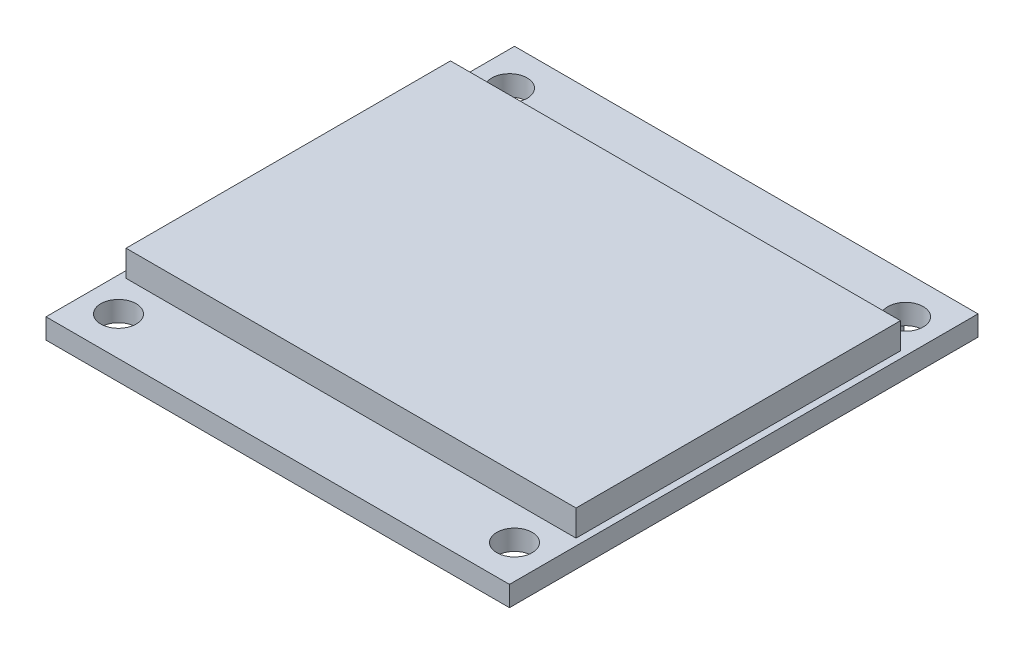
ISO-10303-21;
HEADER;
FILE_DESCRIPTION(('STEP AP214'),'2;1');
FILE_NAME('part.step','',(''),(''),'','','');
FILE_SCHEMA(('AUTOMOTIVE_DESIGN { 1 0 10303 214 1 1 1 1 }'));
ENDSEC;
DATA;
#1=APPLICATION_CONTEXT('core data for automotive mechanical design processes');
#2=APPLICATION_PROTOCOL_DEFINITION('international standard','automotive_design',2000,#1);
#3=PRODUCT_CONTEXT('',#1,'mechanical');
#4=PRODUCT('Part','Part','',(#3));
#5=PRODUCT_RELATED_PRODUCT_CATEGORY('part','',(#4));
#6=PRODUCT_DEFINITION_FORMATION('','',#4);
#7=PRODUCT_DEFINITION_CONTEXT('part definition',#1,'design');
#8=PRODUCT_DEFINITION('design','',#6,#7);
#9=PRODUCT_DEFINITION_SHAPE('','',#8);
#10=(LENGTH_UNIT() NAMED_UNIT(*) SI_UNIT(.MILLI.,.METRE.));
#11=(NAMED_UNIT(*) PLANE_ANGLE_UNIT() SI_UNIT($,.RADIAN.));
#12=(NAMED_UNIT(*) SI_UNIT($,.STERADIAN.) SOLID_ANGLE_UNIT());
#13=UNCERTAINTY_MEASURE_WITH_UNIT(LENGTH_MEASURE(1.E-05),#10,'distance_accuracy_value','');
#14=(GEOMETRIC_REPRESENTATION_CONTEXT(3) GLOBAL_UNCERTAINTY_ASSIGNED_CONTEXT((#13)) GLOBAL_UNIT_ASSIGNED_CONTEXT((#10,
#11,#12)) REPRESENTATION_CONTEXT('',''));
#15=CARTESIAN_POINT('',(0.,0.,0.));
#16=DIRECTION('',(0.,0.,1.));
#17=DIRECTION('',(1.,0.,0.));
#18=AXIS2_PLACEMENT_3D('',#15,#16,#17);
#19=CARTESIAN_POINT('',(0.,0.,0.));
#20=DIRECTION('',(0.,1.,0.));
#21=DIRECTION('',(0.,0.,1.));
#22=AXIS2_PLACEMENT_3D('',#19,#20,#21);
#23=PLANE('',#22);
#24=CARTESIAN_POINT('',(-19.7369956428169,0.,7.52126995897853));
#25=DIRECTION('',(0.,1.,0.));
#26=DIRECTION('',(0.,0.,1.));
#27=AXIS2_PLACEMENT_3D('',#24,#25,#26);
#28=CIRCLE('',#27,1.05);
#29=CARTESIAN_POINT('',(-19.7369956428169,0.,8.57126995897853));
#30=VERTEX_POINT('',#29);
#31=EDGE_CURVE('E177',#30,#30,#28,.T.);
#32=ORIENTED_EDGE('',*,*,#31,.T.);
#33=EDGE_LOOP('',(#32));
#34=FACE_BOUND('',#33,.T.);
#35=CARTESIAN_POINT('',(3.76300435718308,0.,-15.6787300410215));
#36=DIRECTION('',(0.,1.,0.));
#37=DIRECTION('',(0.,0.,1.));
#38=AXIS2_PLACEMENT_3D('',#35,#36,#37);
#39=CIRCLE('',#38,1.05);
#40=CARTESIAN_POINT('',(3.76300435718308,0.,-14.6287300410215));
#41=VERTEX_POINT('',#40);
#42=EDGE_CURVE('E187',#41,#41,#39,.T.);
#43=ORIENTED_EDGE('',*,*,#42,.T.);
#44=EDGE_LOOP('',(#43));
#45=FACE_BOUND('',#44,.T.);
#46=DIRECTION('',(0.,0.,1.));
#47=VECTOR('',#46,1.);
#48=CARTESIAN_POINT('',(-21.7369956428169,0.,-17.9787300410215));
#49=LINE('',#48,#47);
#50=CARTESIAN_POINT('',(-21.7369956428169,0.,-17.9787300410215));
#51=VERTEX_POINT('',#50);
#52=CARTESIAN_POINT('',(-21.7369956428169,0.,9.82126995897853));
#53=VERTEX_POINT('',#52);
#54=EDGE_CURVE('E199',#51,#53,#49,.T.);
#55=ORIENTED_EDGE('',*,*,#54,.F.);
#56=DIRECTION('',(-1.,0.,0.));
#57=VECTOR('',#56,1.);
#58=CARTESIAN_POINT('',(-21.7369956428169,0.,-17.9787300410215));
#59=LINE('',#58,#57);
#60=CARTESIAN_POINT('',(5.76300435718307,0.,-17.9787300410215));
#61=VERTEX_POINT('',#60);
#62=EDGE_CURVE('E206',#61,#51,#59,.T.);
#63=ORIENTED_EDGE('',*,*,#62,.F.);
#64=DIRECTION('',(0.,0.,-1.));
#65=VECTOR('',#64,1.);
#66=CARTESIAN_POINT('',(5.76300435718307,0.,-17.9787300410215));
#67=LINE('',#66,#65);
#68=CARTESIAN_POINT('',(5.76300435718308,0.,9.82126995897853));
#69=VERTEX_POINT('',#68);
#70=EDGE_CURVE('E217',#69,#61,#67,.T.);
#71=ORIENTED_EDGE('',*,*,#70,.F.);
#72=DIRECTION('',(1.,0.,0.));
#73=VECTOR('',#72,1.);
#74=CARTESIAN_POINT('',(-21.7369956428169,0.,9.82126995897853));
#75=LINE('',#74,#73);
#76=EDGE_CURVE('E215',#53,#69,#75,.T.);
#77=ORIENTED_EDGE('',*,*,#76,.F.);
#78=EDGE_LOOP('',(#55,#63,#71,#77));
#79=FACE_BOUND('',#78,.T.);
#80=CARTESIAN_POINT('',(-19.7369956428169,0.,-15.6787300410215));
#81=DIRECTION('',(0.,1.,0.));
#82=DIRECTION('',(0.,0.,1.));
#83=AXIS2_PLACEMENT_3D('',#80,#81,#82);
#84=CIRCLE('',#83,1.05);
#85=CARTESIAN_POINT('',(-19.7369956428169,0.,-14.6287300410215));
#86=VERTEX_POINT('',#85);
#87=EDGE_CURVE('E193',#86,#86,#84,.T.);
#88=ORIENTED_EDGE('',*,*,#87,.T.);
#89=EDGE_LOOP('',(#88));
#90=FACE_BOUND('',#89,.T.);
#91=CARTESIAN_POINT('',(3.76300435718308,0.,7.52126995897853));
#92=DIRECTION('',(0.,1.,0.));
#93=DIRECTION('',(0.,0.,1.));
#94=AXIS2_PLACEMENT_3D('',#91,#92,#93);
#95=CIRCLE('',#94,1.05);
#96=CARTESIAN_POINT('',(3.76300435718308,0.,8.57126995897853));
#97=VERTEX_POINT('',#96);
#98=EDGE_CURVE('E181',#97,#97,#95,.T.);
#99=ORIENTED_EDGE('',*,*,#98,.T.);
#100=EDGE_LOOP('',(#99));
#101=FACE_BOUND('',#100,.T.);
#102=DIRECTION('',(0.,0.,1.));
#103=VECTOR('',#102,1.);
#104=CARTESIAN_POINT('',(1.61868176220332,0.,-17.7287300410215));
#105=LINE('',#104,#103);
#106=CARTESIAN_POINT('',(1.61868176220332,0.,-17.7287300410215));
#107=VERTEX_POINT('',#106);
#108=CARTESIAN_POINT('',(1.61868176220332,0.,-15.1787300410215));
#109=VERTEX_POINT('',#108);
#110=EDGE_CURVE('E142',#107,#109,#105,.T.);
#111=ORIENTED_EDGE('',*,*,#110,.F.);
#112=DIRECTION('',(1.,0.,0.));
#113=VECTOR('',#112,1.);
#114=CARTESIAN_POINT('',(1.61868176220332,0.,-17.7287300410215));
#115=LINE('',#114,#113);
#116=CARTESIAN_POINT('',(-16.1313182377967,0.,-17.7287300410215));
#117=VERTEX_POINT('',#116);
#118=EDGE_CURVE('E139',#117,#107,#115,.T.);
#119=ORIENTED_EDGE('',*,*,#118,.F.);
#120=DIRECTION('',(0.,0.,-1.));
#121=VECTOR('',#120,1.);
#122=CARTESIAN_POINT('',(-16.1313182377967,0.,-17.7287300410215));
#123=LINE('',#122,#121);
#124=CARTESIAN_POINT('',(-16.1313182377967,0.,-15.1787300410215));
#125=VERTEX_POINT('',#124);
#126=EDGE_CURVE('E53',#125,#117,#123,.T.);
#127=ORIENTED_EDGE('',*,*,#126,.F.);
#128=DIRECTION('',(-1.,0.,0.));
#129=VECTOR('',#128,1.);
#130=CARTESIAN_POINT('',(1.61868176220332,0.,-15.1787300410215));
#131=LINE('',#130,#129);
#132=EDGE_CURVE('E48',#109,#125,#131,.T.);
#133=ORIENTED_EDGE('',*,*,#132,.F.);
#134=EDGE_LOOP('',(#111,#119,#127,#133));
#135=FACE_BOUND('',#134,.T.);
#136=ADVANCED_FACE('F33',(#34,#45,#79,#90,#101,#135),#23,.F.);
#137=CARTESIAN_POINT('',(0.,1.2,0.));
#138=DIRECTION('',(0.,1.,0.));
#139=DIRECTION('',(0.,0.,1.));
#140=AXIS2_PLACEMENT_3D('',#137,#138,#139);
#141=PLANE('',#140);
#142=CARTESIAN_POINT('',(-19.7369956428169,1.2,7.52126995897853));
#143=DIRECTION('',(0.,1.,0.));
#144=DIRECTION('',(0.,0.,1.));
#145=AXIS2_PLACEMENT_3D('',#142,#143,#144);
#146=CIRCLE('',#145,1.05);
#147=CARTESIAN_POINT('',(-19.7369956428169,1.2,8.57126995897853));
#148=VERTEX_POINT('',#147);
#149=EDGE_CURVE('E178',#148,#148,#146,.T.);
#150=ORIENTED_EDGE('',*,*,#149,.F.);
#151=EDGE_LOOP('',(#150));
#152=FACE_BOUND('',#151,.T.);
#153=CARTESIAN_POINT('',(3.76300435718308,1.2,-15.6787300410215));
#154=DIRECTION('',(0.,1.,0.));
#155=DIRECTION('',(0.,0.,1.));
#156=AXIS2_PLACEMENT_3D('',#153,#154,#155);
#157=CIRCLE('',#156,1.05);
#158=CARTESIAN_POINT('',(3.76300435718308,1.2,-14.6287300410215));
#159=VERTEX_POINT('',#158);
#160=EDGE_CURVE('E190',#159,#159,#157,.T.);
#161=ORIENTED_EDGE('',*,*,#160,.F.);
#162=EDGE_LOOP('',(#161));
#163=FACE_BOUND('',#162,.T.);
#164=DIRECTION('',(0.,0.,1.));
#165=VECTOR('',#164,1.);
#166=CARTESIAN_POINT('',(-21.7369956428169,1.2,-17.9787300410215));
#167=LINE('',#166,#165);
#168=CARTESIAN_POINT('',(-21.7369956428169,1.2,-17.9787300410215));
#169=VERTEX_POINT('',#168);
#170=CARTESIAN_POINT('',(-21.7369956428169,1.2,9.82126995897853));
#171=VERTEX_POINT('',#170);
#172=EDGE_CURVE('E202',#169,#171,#167,.T.);
#173=ORIENTED_EDGE('',*,*,#172,.T.);
#174=DIRECTION('',(1.,0.,0.));
#175=VECTOR('',#174,1.);
#176=CARTESIAN_POINT('',(-21.7369956428169,1.2,9.82126995897853));
#177=LINE('',#176,#175);
#178=CARTESIAN_POINT('',(5.76300435718308,1.2,9.82126995897853));
#179=VERTEX_POINT('',#178);
#180=EDGE_CURVE('E205',#171,#179,#177,.T.);
#181=ORIENTED_EDGE('',*,*,#180,.T.);
#182=DIRECTION('',(0.,0.,-1.));
#183=VECTOR('',#182,1.);
#184=CARTESIAN_POINT('',(5.76300435718307,1.2,-17.9787300410215));
#185=LINE('',#184,#183);
#186=CARTESIAN_POINT('',(5.76300435718307,1.2,-17.9787300410215));
#187=VERTEX_POINT('',#186);
#188=EDGE_CURVE('E208',#179,#187,#185,.T.);
#189=ORIENTED_EDGE('',*,*,#188,.T.);
#190=DIRECTION('',(-1.,0.,0.));
#191=VECTOR('',#190,1.);
#192=CARTESIAN_POINT('',(-21.7369956428169,1.2,-17.9787300410215));
#193=LINE('',#192,#191);
#194=EDGE_CURVE('E210',#187,#169,#193,.T.);
#195=ORIENTED_EDGE('',*,*,#194,.T.);
#196=EDGE_LOOP('',(#173,#181,#189,#195));
#197=FACE_BOUND('',#196,.T.);
#198=CARTESIAN_POINT('',(-19.7369956428169,1.2,-15.6787300410215));
#199=DIRECTION('',(0.,1.,0.));
#200=DIRECTION('',(0.,0.,1.));
#201=AXIS2_PLACEMENT_3D('',#198,#199,#200);
#202=CIRCLE('',#201,1.05);
#203=CARTESIAN_POINT('',(-19.7369956428169,1.2,-14.6287300410215));
#204=VERTEX_POINT('',#203);
#205=EDGE_CURVE('E196',#204,#204,#202,.T.);
#206=ORIENTED_EDGE('',*,*,#205,.F.);
#207=EDGE_LOOP('',(#206));
#208=FACE_BOUND('',#207,.T.);
#209=CARTESIAN_POINT('',(3.76300435718308,1.2,7.52126995897853));
#210=DIRECTION('',(0.,1.,0.));
#211=DIRECTION('',(0.,0.,1.));
#212=AXIS2_PLACEMENT_3D('',#209,#210,#211);
#213=CIRCLE('',#212,1.05);
#214=CARTESIAN_POINT('',(3.76300435718308,1.2,8.57126995897853));
#215=VERTEX_POINT('',#214);
#216=EDGE_CURVE('E184',#215,#215,#213,.T.);
#217=ORIENTED_EDGE('',*,*,#216,.F.);
#218=EDGE_LOOP('',(#217));
#219=FACE_BOUND('',#218,.T.);
#220=DIRECTION('',(1.,0.,0.));
#221=VECTOR('',#220,1.);
#222=CARTESIAN_POINT('',(-21.3369956428169,1.2,5.47126995897852));
#223=LINE('',#222,#221);
#224=CARTESIAN_POINT('',(-21.3369956428169,1.2,5.47126995897852));
#225=VERTEX_POINT('',#224);
#226=CARTESIAN_POINT('',(5.36300435718308,1.2,5.47126995897852));
#227=VERTEX_POINT('',#226);
#228=EDGE_CURVE('E146',#225,#227,#223,.T.);
#229=ORIENTED_EDGE('',*,*,#228,.F.);
#230=DIRECTION('',(0.,0.,1.));
#231=VECTOR('',#230,1.);
#232=CARTESIAN_POINT('',(-21.3369956428169,1.2,-13.7787300410215));
#233=LINE('',#232,#231);
#234=CARTESIAN_POINT('',(-21.3369956428169,1.2,-13.7787300410215));
#235=VERTEX_POINT('',#234);
#236=EDGE_CURVE('E143',#235,#225,#233,.T.);
#237=ORIENTED_EDGE('',*,*,#236,.F.);
#238=DIRECTION('',(-1.,0.,0.));
#239=VECTOR('',#238,1.);
#240=CARTESIAN_POINT('',(-21.3369956428169,1.2,-13.7787300410215));
#241=LINE('',#240,#239);
#242=CARTESIAN_POINT('',(5.36300435718308,1.2,-13.7787300410215));
#243=VERTEX_POINT('',#242);
#244=EDGE_CURVE('E156',#243,#235,#241,.T.);
#245=ORIENTED_EDGE('',*,*,#244,.F.);
#246=DIRECTION('',(0.,0.,-1.));
#247=VECTOR('',#246,1.);
#248=CARTESIAN_POINT('',(5.36300435718308,1.2,-13.7787300410215));
#249=LINE('',#248,#247);
#250=EDGE_CURVE('E164',#227,#243,#249,.T.);
#251=ORIENTED_EDGE('',*,*,#250,.F.);
#252=EDGE_LOOP('',(#229,#237,#245,#251));
#253=FACE_BOUND('',#252,.T.);
#254=ADVANCED_FACE('F244',(#152,#163,#197,#208,#219,#253),#141,.T.);
#255=CARTESIAN_POINT('',(-21.7369956428169,1.2,-17.9787300410215));
#256=DIRECTION('',(1.,0.,0.));
#257=DIRECTION('',(0.,0.,-1.));
#258=AXIS2_PLACEMENT_3D('',#255,#256,#257);
#259=PLANE('',#258);
#260=ORIENTED_EDGE('',*,*,#54,.T.);
#261=DIRECTION('',(0.,-1.,0.));
#262=VECTOR('',#261,1.);
#263=CARTESIAN_POINT('',(-21.7369956428169,1.2,9.82126995897853));
#264=LINE('',#263,#262);
#265=EDGE_CURVE('E11',#171,#53,#264,.T.);
#266=ORIENTED_EDGE('',*,*,#265,.F.);
#267=ORIENTED_EDGE('',*,*,#172,.F.);
#268=DIRECTION('',(0.,-1.,0.));
#269=VECTOR('',#268,1.);
#270=CARTESIAN_POINT('',(-21.7369956428169,1.2,-17.9787300410215));
#271=LINE('',#270,#269);
#272=EDGE_CURVE('E212',#169,#51,#271,.T.);
#273=ORIENTED_EDGE('',*,*,#272,.T.);
#274=EDGE_LOOP('',(#260,#266,#267,#273));
#275=FACE_BOUND('',#274,.T.);
#276=ADVANCED_FACE('F35',(#275),#259,.F.);
#277=CARTESIAN_POINT('',(-21.7369956428169,1.2,9.82126995897853));
#278=DIRECTION('',(0.,0.,-1.));
#279=DIRECTION('',(-1.,0.,0.));
#280=AXIS2_PLACEMENT_3D('',#277,#278,#279);
#281=PLANE('',#280);
#282=ORIENTED_EDGE('',*,*,#76,.T.);
#283=DIRECTION('',(0.,-1.,0.));
#284=VECTOR('',#283,1.);
#285=CARTESIAN_POINT('',(5.76300435718308,1.2,9.82126995897853));
#286=LINE('',#285,#284);
#287=EDGE_CURVE('E41',#179,#69,#286,.T.);
#288=ORIENTED_EDGE('',*,*,#287,.F.);
#289=ORIENTED_EDGE('',*,*,#180,.F.);
#290=ORIENTED_EDGE('',*,*,#265,.T.);
#291=EDGE_LOOP('',(#282,#288,#289,#290));
#292=FACE_BOUND('',#291,.T.);
#293=ADVANCED_FACE('F246',(#292),#281,.F.);
#294=CARTESIAN_POINT('',(5.76300435718307,1.2,-17.9787300410215));
#295=DIRECTION('',(-1.,0.,0.));
#296=DIRECTION('',(0.,0.,1.));
#297=AXIS2_PLACEMENT_3D('',#294,#295,#296);
#298=PLANE('',#297);
#299=ORIENTED_EDGE('',*,*,#70,.T.);
#300=DIRECTION('',(0.,-1.,0.));
#301=VECTOR('',#300,1.);
#302=CARTESIAN_POINT('',(5.76300435718307,1.2,-17.9787300410215));
#303=LINE('',#302,#301);
#304=EDGE_CURVE('E222',#187,#61,#303,.T.);
#305=ORIENTED_EDGE('',*,*,#304,.F.);
#306=ORIENTED_EDGE('',*,*,#188,.F.);
#307=ORIENTED_EDGE('',*,*,#287,.T.);
#308=EDGE_LOOP('',(#299,#305,#306,#307));
#309=FACE_BOUND('',#308,.T.);
#310=ADVANCED_FACE('F229',(#309),#298,.F.);
#311=CARTESIAN_POINT('',(-21.7369956428169,1.2,-17.9787300410215));
#312=DIRECTION('',(0.,0.,1.));
#313=DIRECTION('',(1.,0.,0.));
#314=AXIS2_PLACEMENT_3D('',#311,#312,#313);
#315=PLANE('',#314);
#316=ORIENTED_EDGE('',*,*,#62,.T.);
#317=ORIENTED_EDGE('',*,*,#272,.F.);
#318=ORIENTED_EDGE('',*,*,#194,.F.);
#319=ORIENTED_EDGE('',*,*,#304,.T.);
#320=EDGE_LOOP('',(#316,#317,#318,#319));
#321=FACE_BOUND('',#320,.T.);
#322=ADVANCED_FACE('F238',(#321),#315,.F.);
#323=CARTESIAN_POINT('',(-19.7369956428169,1.2,-15.6787300410215));
#324=DIRECTION('',(0.,-1.,0.));
#325=DIRECTION('',(0.,0.,-1.));
#326=AXIS2_PLACEMENT_3D('',#323,#324,#325);
#327=CYLINDRICAL_SURFACE('',#326,1.05);
#328=ORIENTED_EDGE('',*,*,#205,.T.);
#329=EDGE_LOOP('',(#328));
#330=FACE_BOUND('',#329,.T.);
#331=ORIENTED_EDGE('',*,*,#87,.F.);
#332=EDGE_LOOP('',(#331));
#333=FACE_BOUND('',#332,.T.);
#334=ADVANCED_FACE('F265',(#330,#333),#327,.F.);
#335=CARTESIAN_POINT('',(3.76300435718308,1.2,-15.6787300410215));
#336=DIRECTION('',(0.,-1.,0.));
#337=DIRECTION('',(0.,0.,-1.));
#338=AXIS2_PLACEMENT_3D('',#335,#336,#337);
#339=CYLINDRICAL_SURFACE('',#338,1.05);
#340=ORIENTED_EDGE('',*,*,#160,.T.);
#341=EDGE_LOOP('',(#340));
#342=FACE_BOUND('',#341,.T.);
#343=ORIENTED_EDGE('',*,*,#42,.F.);
#344=EDGE_LOOP('',(#343));
#345=FACE_BOUND('',#344,.T.);
#346=ADVANCED_FACE('F269',(#342,#345),#339,.F.);
#347=CARTESIAN_POINT('',(3.76300435718308,1.2,7.52126995897853));
#348=DIRECTION('',(0.,-1.,0.));
#349=DIRECTION('',(0.,0.,-1.));
#350=AXIS2_PLACEMENT_3D('',#347,#348,#349);
#351=CYLINDRICAL_SURFACE('',#350,1.05);
#352=ORIENTED_EDGE('',*,*,#216,.T.);
#353=EDGE_LOOP('',(#352));
#354=FACE_BOUND('',#353,.T.);
#355=ORIENTED_EDGE('',*,*,#98,.F.);
#356=EDGE_LOOP('',(#355));
#357=FACE_BOUND('',#356,.T.);
#358=ADVANCED_FACE('F274',(#354,#357),#351,.F.);
#359=CARTESIAN_POINT('',(-19.7369956428169,1.2,7.52126995897853));
#360=DIRECTION('',(0.,-1.,0.));
#361=DIRECTION('',(0.,0.,-1.));
#362=AXIS2_PLACEMENT_3D('',#359,#360,#361);
#363=CYLINDRICAL_SURFACE('',#362,1.05);
#364=ORIENTED_EDGE('',*,*,#149,.T.);
#365=EDGE_LOOP('',(#364));
#366=FACE_BOUND('',#365,.T.);
#367=ORIENTED_EDGE('',*,*,#31,.F.);
#368=EDGE_LOOP('',(#367));
#369=FACE_BOUND('',#368,.T.);
#370=ADVANCED_FACE('F281',(#366,#369),#363,.F.);
#371=CARTESIAN_POINT('',(-21.3369956428169,2.75,-13.7787300410215));
#372=DIRECTION('',(1.,0.,0.));
#373=DIRECTION('',(0.,0.,-1.));
#374=AXIS2_PLACEMENT_3D('',#371,#372,#373);
#375=PLANE('',#374);
#376=ORIENTED_EDGE('',*,*,#236,.T.);
#377=DIRECTION('',(0.,-1.,0.));
#378=VECTOR('',#377,1.);
#379=CARTESIAN_POINT('',(-21.3369956428169,2.75,5.47126995897852));
#380=LINE('',#379,#378);
#381=CARTESIAN_POINT('',(-21.3369956428169,2.75,5.47126995897852));
#382=VERTEX_POINT('',#381);
#383=EDGE_CURVE('E175',#382,#225,#380,.T.);
#384=ORIENTED_EDGE('',*,*,#383,.F.);
#385=DIRECTION('',(0.,0.,1.));
#386=VECTOR('',#385,1.);
#387=CARTESIAN_POINT('',(-21.3369956428169,2.75,-13.7787300410215));
#388=LINE('',#387,#386);
#389=CARTESIAN_POINT('',(-21.3369956428169,2.75,-13.7787300410215));
#390=VERTEX_POINT('',#389);
#391=EDGE_CURVE('E152',#390,#382,#388,.T.);
#392=ORIENTED_EDGE('',*,*,#391,.F.);
#393=DIRECTION('',(0.,-1.,0.));
#394=VECTOR('',#393,1.);
#395=CARTESIAN_POINT('',(-21.3369956428169,2.75,-13.7787300410215));
#396=LINE('',#395,#394);
#397=EDGE_CURVE('E161',#390,#235,#396,.T.);
#398=ORIENTED_EDGE('',*,*,#397,.T.);
#399=EDGE_LOOP('',(#376,#384,#392,#398));
#400=FACE_BOUND('',#399,.T.);
#401=ADVANCED_FACE('F285',(#400),#375,.F.);
#402=CARTESIAN_POINT('',(-21.3369956428169,2.75,5.47126995897852));
#403=DIRECTION('',(0.,0.,-1.));
#404=DIRECTION('',(-1.,0.,0.));
#405=AXIS2_PLACEMENT_3D('',#402,#403,#404);
#406=PLANE('',#405);
#407=ORIENTED_EDGE('',*,*,#228,.T.);
#408=DIRECTION('',(0.,-1.,0.));
#409=VECTOR('',#408,1.);
#410=CARTESIAN_POINT('',(5.36300435718308,2.75,5.47126995897852));
#411=LINE('',#410,#409);
#412=CARTESIAN_POINT('',(5.36300435718308,2.75,5.47126995897852));
#413=VERTEX_POINT('',#412);
#414=EDGE_CURVE('E172',#413,#227,#411,.T.);
#415=ORIENTED_EDGE('',*,*,#414,.F.);
#416=DIRECTION('',(1.,0.,0.));
#417=VECTOR('',#416,1.);
#418=CARTESIAN_POINT('',(-21.3369956428169,2.75,5.47126995897852));
#419=LINE('',#418,#417);
#420=EDGE_CURVE('E155',#382,#413,#419,.T.);
#421=ORIENTED_EDGE('',*,*,#420,.F.);
#422=ORIENTED_EDGE('',*,*,#383,.T.);
#423=EDGE_LOOP('',(#407,#415,#421,#422));
#424=FACE_BOUND('',#423,.T.);
#425=ADVANCED_FACE('F289',(#424),#406,.F.);
#426=CARTESIAN_POINT('',(5.36300435718308,2.75,-13.7787300410215));
#427=DIRECTION('',(-1.,0.,0.));
#428=DIRECTION('',(0.,0.,1.));
#429=AXIS2_PLACEMENT_3D('',#426,#427,#428);
#430=PLANE('',#429);
#431=ORIENTED_EDGE('',*,*,#250,.T.);
#432=DIRECTION('',(0.,-1.,0.));
#433=VECTOR('',#432,1.);
#434=CARTESIAN_POINT('',(5.36300435718308,2.75,-13.7787300410215));
#435=LINE('',#434,#433);
#436=CARTESIAN_POINT('',(5.36300435718308,2.75,-13.7787300410215));
#437=VERTEX_POINT('',#436);
#438=EDGE_CURVE('E170',#437,#243,#435,.T.);
#439=ORIENTED_EDGE('',*,*,#438,.F.);
#440=DIRECTION('',(0.,0.,-1.));
#441=VECTOR('',#440,1.);
#442=CARTESIAN_POINT('',(5.36300435718308,2.75,-13.7787300410215));
#443=LINE('',#442,#441);
#444=EDGE_CURVE('E158',#413,#437,#443,.T.);
#445=ORIENTED_EDGE('',*,*,#444,.F.);
#446=ORIENTED_EDGE('',*,*,#414,.T.);
#447=EDGE_LOOP('',(#431,#439,#445,#446));
#448=FACE_BOUND('',#447,.T.);
#449=ADVANCED_FACE('F293',(#448),#430,.F.);
#450=CARTESIAN_POINT('',(-21.3369956428169,2.75,-13.7787300410215));
#451=DIRECTION('',(0.,0.,1.));
#452=DIRECTION('',(1.,0.,0.));
#453=AXIS2_PLACEMENT_3D('',#450,#451,#452);
#454=PLANE('',#453);
#455=ORIENTED_EDGE('',*,*,#244,.T.);
#456=ORIENTED_EDGE('',*,*,#397,.F.);
#457=DIRECTION('',(-1.,0.,0.));
#458=VECTOR('',#457,1.);
#459=CARTESIAN_POINT('',(-21.3369956428169,2.75,-13.7787300410215));
#460=LINE('',#459,#458);
#461=EDGE_CURVE('E160',#437,#390,#460,.T.);
#462=ORIENTED_EDGE('',*,*,#461,.F.);
#463=ORIENTED_EDGE('',*,*,#438,.T.);
#464=EDGE_LOOP('',(#455,#456,#462,#463));
#465=FACE_BOUND('',#464,.T.);
#466=ADVANCED_FACE('F297',(#465),#454,.F.);
#467=CARTESIAN_POINT('',(0.,2.75,0.));
#468=DIRECTION('',(0.,1.,0.));
#469=DIRECTION('',(0.,0.,1.));
#470=AXIS2_PLACEMENT_3D('',#467,#468,#469);
#471=PLANE('',#470);
#472=ORIENTED_EDGE('',*,*,#391,.T.);
#473=ORIENTED_EDGE('',*,*,#420,.T.);
#474=ORIENTED_EDGE('',*,*,#444,.T.);
#475=ORIENTED_EDGE('',*,*,#461,.T.);
#476=EDGE_LOOP('',(#472,#473,#474,#475));
#477=FACE_BOUND('',#476,.T.);
#478=ADVANCED_FACE('F301',(#477),#471,.T.);
#479=CARTESIAN_POINT('',(1.61868176220332,-2.35,-17.7287300410215));
#480=DIRECTION('',(-1.,0.,0.));
#481=DIRECTION('',(0.,0.,1.));
#482=AXIS2_PLACEMENT_3D('',#479,#480,#481);
#483=PLANE('',#482);
#484=ORIENTED_EDGE('',*,*,#110,.T.);
#485=DIRECTION('',(0.,1.,0.));
#486=VECTOR('',#485,1.);
#487=CARTESIAN_POINT('',(1.61868176220332,-2.35,-15.1787300410215));
#488=LINE('',#487,#486);
#489=CARTESIAN_POINT('',(1.61868176220332,-2.35,-15.1787300410215));
#490=VERTEX_POINT('',#489);
#491=EDGE_CURVE('E123',#490,#109,#488,.T.);
#492=ORIENTED_EDGE('',*,*,#491,.F.);
#493=DIRECTION('',(0.,0.,1.));
#494=VECTOR('',#493,1.);
#495=CARTESIAN_POINT('',(1.61868176220332,-2.35,-17.7287300410215));
#496=LINE('',#495,#494);
#497=CARTESIAN_POINT('',(1.61868176220332,-2.35,-17.7287300410215));
#498=VERTEX_POINT('',#497);
#499=EDGE_CURVE('E130',#498,#490,#496,.T.);
#500=ORIENTED_EDGE('',*,*,#499,.F.);
#501=DIRECTION('',(0.,1.,0.));
#502=VECTOR('',#501,1.);
#503=CARTESIAN_POINT('',(1.61868176220332,-2.35,-17.7287300410215));
#504=LINE('',#503,#502);
#505=EDGE_CURVE('E433',#498,#107,#504,.T.);
#506=ORIENTED_EDGE('',*,*,#505,.T.);
#507=EDGE_LOOP('',(#484,#492,#500,#506));
#508=FACE_BOUND('',#507,.T.);
#509=ADVANCED_FACE('F141',(#508),#483,.F.);
#510=CARTESIAN_POINT('',(1.61868176220332,-2.35,-15.1787300410215));
#511=DIRECTION('',(0.,0.,-1.));
#512=DIRECTION('',(-1.,0.,0.));
#513=AXIS2_PLACEMENT_3D('',#510,#511,#512);
#514=PLANE('',#513);
#515=ORIENTED_EDGE('',*,*,#132,.T.);
#516=DIRECTION('',(0.,1.,0.));
#517=VECTOR('',#516,1.);
#518=CARTESIAN_POINT('',(-16.1313182377967,-2.35,-15.1787300410215));
#519=LINE('',#518,#517);
#520=CARTESIAN_POINT('',(-16.1313182377967,-2.35,-15.1787300410215));
#521=VERTEX_POINT('',#520);
#522=EDGE_CURVE('E126',#521,#125,#519,.T.);
#523=ORIENTED_EDGE('',*,*,#522,.F.);
#524=DIRECTION('',(-1.,0.,0.));
#525=VECTOR('',#524,1.);
#526=CARTESIAN_POINT('',(1.61868176220332,-2.35,-15.1787300410215));
#527=LINE('',#526,#525);
#528=EDGE_CURVE('E119',#490,#521,#527,.T.);
#529=ORIENTED_EDGE('',*,*,#528,.F.);
#530=ORIENTED_EDGE('',*,*,#491,.T.);
#531=EDGE_LOOP('',(#515,#523,#529,#530));
#532=FACE_BOUND('',#531,.T.);
#533=ADVANCED_FACE('F121',(#532),#514,.F.);
#534=CARTESIAN_POINT('',(-16.1313182377967,-2.35,-17.7287300410215));
#535=DIRECTION('',(1.,0.,0.));
#536=DIRECTION('',(0.,0.,-1.));
#537=AXIS2_PLACEMENT_3D('',#534,#535,#536);
#538=PLANE('',#537);
#539=ORIENTED_EDGE('',*,*,#126,.T.);
#540=DIRECTION('',(0.,1.,0.));
#541=VECTOR('',#540,1.);
#542=CARTESIAN_POINT('',(-16.1313182377967,-2.35,-17.7287300410215));
#543=LINE('',#542,#541);
#544=CARTESIAN_POINT('',(-16.1313182377967,-2.35,-17.7287300410215));
#545=VERTEX_POINT('',#544);
#546=EDGE_CURVE('E148',#545,#117,#543,.T.);
#547=ORIENTED_EDGE('',*,*,#546,.F.);
#548=DIRECTION('',(0.,0.,-1.));
#549=VECTOR('',#548,1.);
#550=CARTESIAN_POINT('',(-16.1313182377967,-2.35,-17.7287300410215));
#551=LINE('',#550,#549);
#552=EDGE_CURVE('E129',#521,#545,#551,.T.);
#553=ORIENTED_EDGE('',*,*,#552,.F.);
#554=ORIENTED_EDGE('',*,*,#522,.T.);
#555=EDGE_LOOP('',(#539,#547,#553,#554));
#556=FACE_BOUND('',#555,.T.);
#557=ADVANCED_FACE('F310',(#556),#538,.F.);
#558=CARTESIAN_POINT('',(1.61868176220332,-2.35,-17.7287300410215));
#559=DIRECTION('',(0.,0.,1.));
#560=DIRECTION('',(1.,0.,0.));
#561=AXIS2_PLACEMENT_3D('',#558,#559,#560);
#562=PLANE('',#561);
#563=ORIENTED_EDGE('',*,*,#118,.T.);
#564=ORIENTED_EDGE('',*,*,#505,.F.);
#565=DIRECTION('',(1.,0.,0.));
#566=VECTOR('',#565,1.);
#567=CARTESIAN_POINT('',(1.61868176220332,-2.35,-17.7287300410215));
#568=LINE('',#567,#566);
#569=EDGE_CURVE('E135',#545,#498,#568,.T.);
#570=ORIENTED_EDGE('',*,*,#569,.F.);
#571=ORIENTED_EDGE('',*,*,#546,.T.);
#572=EDGE_LOOP('',(#563,#564,#570,#571));
#573=FACE_BOUND('',#572,.T.);
#574=ADVANCED_FACE('F313',(#573),#562,.F.);
#575=CARTESIAN_POINT('',(0.,-2.35,0.));
#576=DIRECTION('',(0.,-1.,0.));
#577=DIRECTION('',(0.,0.,-1.));
#578=AXIS2_PLACEMENT_3D('',#575,#576,#577);
#579=PLANE('',#578);
#580=ORIENTED_EDGE('',*,*,#499,.T.);
#581=ORIENTED_EDGE('',*,*,#528,.T.);
#582=ORIENTED_EDGE('',*,*,#552,.T.);
#583=ORIENTED_EDGE('',*,*,#569,.T.);
#584=EDGE_LOOP('',(#580,#581,#582,#583));
#585=FACE_BOUND('',#584,.T.);
#586=ADVANCED_FACE('F133',(#585),#579,.T.);
#587=CLOSED_SHELL('',(#136,#254,#276,#293,#310,#322,#334,#346,#358,#370,#401,#425,#449,#466,
#478,#509,#533,#557,#574,#586));
#588=MANIFOLD_SOLID_BREP('B2',#587);
#589=ADVANCED_BREP_SHAPE_REPRESENTATION('',(#18,#588),#14);
#590=SHAPE_DEFINITION_REPRESENTATION(#9,#589);
ENDSEC;
END-ISO-10303-21;
